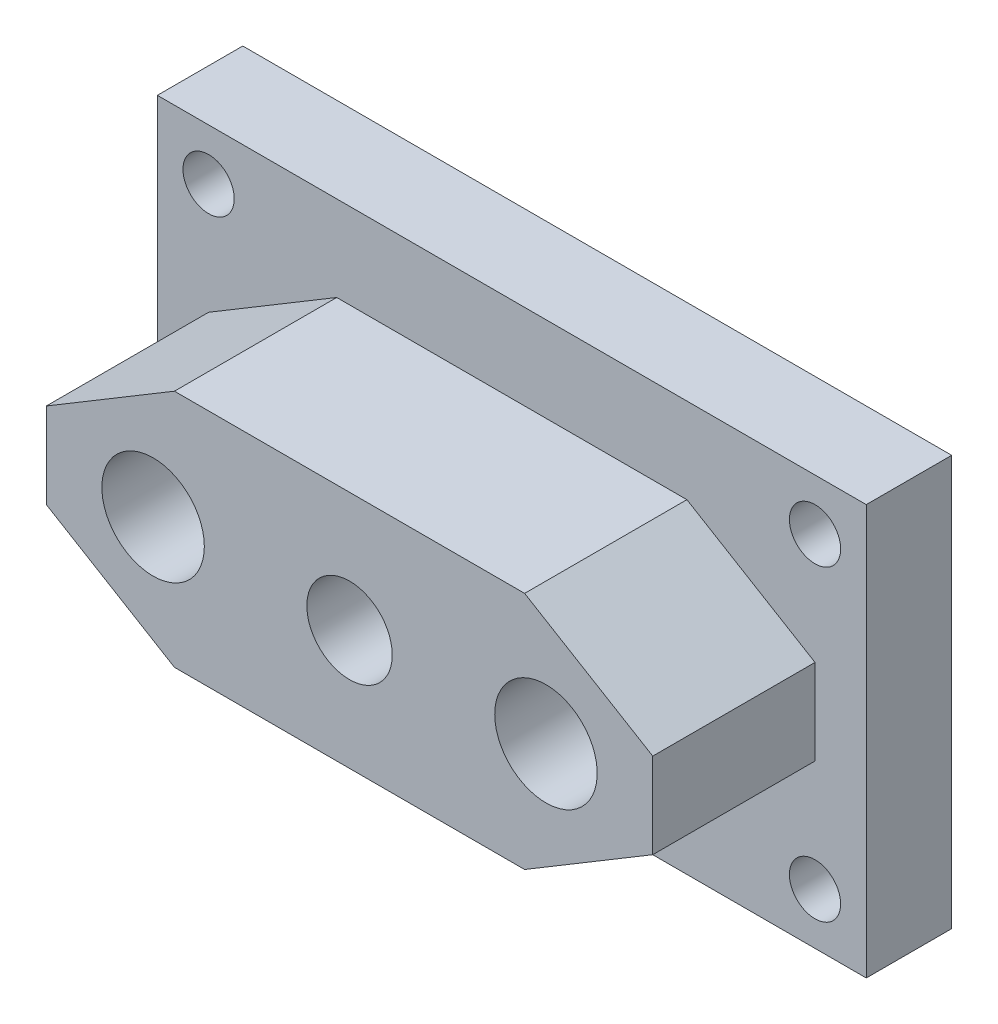
ISO-10303-21;
HEADER;
FILE_DESCRIPTION(('STEP AP214'),'2;1');
FILE_NAME('part.step','',(''),(''),'','','');
FILE_SCHEMA(('AUTOMOTIVE_DESIGN { 1 0 10303 214 1 1 1 1 }'));
ENDSEC;
DATA;
#1=APPLICATION_CONTEXT('core data for automotive mechanical design processes');
#2=APPLICATION_PROTOCOL_DEFINITION('international standard','automotive_design',2000,#1);
#3=PRODUCT_CONTEXT('',#1,'mechanical');
#4=PRODUCT('Part','Part','',(#3));
#5=PRODUCT_RELATED_PRODUCT_CATEGORY('part','',(#4));
#6=PRODUCT_DEFINITION_FORMATION('','',#4);
#7=PRODUCT_DEFINITION_CONTEXT('part definition',#1,'design');
#8=PRODUCT_DEFINITION('design','',#6,#7);
#9=PRODUCT_DEFINITION_SHAPE('','',#8);
#10=(LENGTH_UNIT() NAMED_UNIT(*) SI_UNIT(.MILLI.,.METRE.));
#11=(NAMED_UNIT(*) PLANE_ANGLE_UNIT() SI_UNIT($,.RADIAN.));
#12=(NAMED_UNIT(*) SI_UNIT($,.STERADIAN.) SOLID_ANGLE_UNIT());
#13=UNCERTAINTY_MEASURE_WITH_UNIT(LENGTH_MEASURE(1.E-05),#10,'distance_accuracy_value','');
#14=(GEOMETRIC_REPRESENTATION_CONTEXT(3) GLOBAL_UNCERTAINTY_ASSIGNED_CONTEXT((#13)) GLOBAL_UNIT_ASSIGNED_CONTEXT((#10,
#11,#12)) REPRESENTATION_CONTEXT('',''));
#15=CARTESIAN_POINT('',(0.,0.,0.));
#16=DIRECTION('',(0.,0.,1.));
#17=DIRECTION('',(1.,0.,0.));
#18=AXIS2_PLACEMENT_3D('',#15,#16,#17);
#19=CARTESIAN_POINT('',(0.,0.,10.));
#20=DIRECTION('',(0.,0.,-1.));
#21=DIRECTION('',(-1.,0.,0.));
#22=AXIS2_PLACEMENT_3D('',#19,#20,#21);
#23=PLANE('',#22);
#24=CARTESIAN_POINT('',(-35.5,-18.,10.));
#25=DIRECTION('',(0.,0.,-1.));
#26=DIRECTION('',(-1.,0.,0.));
#27=AXIS2_PLACEMENT_3D('',#24,#25,#26);
#28=CIRCLE('',#27,3.);
#29=CARTESIAN_POINT('',(-38.5,-18.,10.));
#30=VERTEX_POINT('',#29);
#31=EDGE_CURVE('E402',#30,#30,#28,.T.);
#32=ORIENTED_EDGE('',*,*,#31,.T.);
#33=EDGE_LOOP('',(#32));
#34=FACE_BOUND('',#33,.T.);
#35=CARTESIAN_POINT('',(35.5,-18.,10.));
#36=DIRECTION('',(0.,0.,-1.));
#37=DIRECTION('',(-1.,0.,0.));
#38=AXIS2_PLACEMENT_3D('',#35,#36,#37);
#39=CIRCLE('',#38,3.);
#40=CARTESIAN_POINT('',(32.5,-18.,10.));
#41=VERTEX_POINT('',#40);
#42=EDGE_CURVE('E403',#41,#41,#39,.T.);
#43=ORIENTED_EDGE('',*,*,#42,.T.);
#44=EDGE_LOOP('',(#43));
#45=FACE_BOUND('',#44,.T.);
#46=CARTESIAN_POINT('',(35.5,18.,10.));
#47=DIRECTION('',(0.,0.,-1.));
#48=DIRECTION('',(-1.,0.,0.));
#49=AXIS2_PLACEMENT_3D('',#46,#47,#48);
#50=CIRCLE('',#49,3.);
#51=CARTESIAN_POINT('',(32.5,18.,10.));
#52=VERTEX_POINT('',#51);
#53=EDGE_CURVE('E408',#52,#52,#50,.T.);
#54=ORIENTED_EDGE('',*,*,#53,.T.);
#55=EDGE_LOOP('',(#54));
#56=FACE_BOUND('',#55,.T.);
#57=CARTESIAN_POINT('',(-35.5,18.,10.));
#58=DIRECTION('',(0.,0.,-1.));
#59=DIRECTION('',(-1.,0.,0.));
#60=AXIS2_PLACEMENT_3D('',#57,#58,#59);
#61=CIRCLE('',#60,3.);
#62=CARTESIAN_POINT('',(-38.5,18.,10.));
#63=VERTEX_POINT('',#62);
#64=EDGE_CURVE('E463',#63,#63,#61,.T.);
#65=ORIENTED_EDGE('',*,*,#64,.T.);
#66=EDGE_LOOP('',(#65));
#67=FACE_BOUND('',#66,.T.);
#68=DIRECTION('',(0.,1.,0.));
#69=VECTOR('',#68,1.);
#70=CARTESIAN_POINT('',(41.5,-24.,10.));
#71=LINE('',#70,#69);
#72=CARTESIAN_POINT('',(41.5,-24.,10.));
#73=VERTEX_POINT('',#72);
#74=CARTESIAN_POINT('',(41.5,24.,10.));
#75=VERTEX_POINT('',#74);
#76=EDGE_CURVE('E152',#73,#75,#71,.T.);
#77=ORIENTED_EDGE('',*,*,#76,.T.);
#78=DIRECTION('',(-1.,0.,0.));
#79=VECTOR('',#78,1.);
#80=CARTESIAN_POINT('',(-41.5,24.,10.));
#81=LINE('',#80,#79);
#82=CARTESIAN_POINT('',(-41.5,24.,10.));
#83=VERTEX_POINT('',#82);
#84=EDGE_CURVE('E155',#75,#83,#81,.T.);
#85=ORIENTED_EDGE('',*,*,#84,.T.);
#86=DIRECTION('',(0.,-1.,0.));
#87=VECTOR('',#86,1.);
#88=CARTESIAN_POINT('',(-41.5,-24.,10.));
#89=LINE('',#88,#87);
#90=CARTESIAN_POINT('',(-41.5,-24.,10.));
#91=VERTEX_POINT('',#90);
#92=EDGE_CURVE('E158',#83,#91,#89,.T.);
#93=ORIENTED_EDGE('',*,*,#92,.T.);
#94=DIRECTION('',(1.,0.,0.));
#95=VECTOR('',#94,1.);
#96=CARTESIAN_POINT('',(-41.5,-24.,10.));
#97=LINE('',#96,#95);
#98=EDGE_CURVE('E160',#91,#73,#97,.T.);
#99=ORIENTED_EDGE('',*,*,#98,.T.);
#100=EDGE_LOOP('',(#77,#85,#93,#99));
#101=FACE_BOUND('',#100,.T.);
#102=DIRECTION('',(0.,-1.,0.));
#103=VECTOR('',#102,1.);
#104=CARTESIAN_POINT('',(-35.5,-5.,10.));
#105=LINE('',#104,#103);
#106=CARTESIAN_POINT('',(-35.5,5.,10.));
#107=VERTEX_POINT('',#106);
#108=CARTESIAN_POINT('',(-35.5,-5.,10.));
#109=VERTEX_POINT('',#108);
#110=EDGE_CURVE('E49',#107,#109,#105,.T.);
#111=ORIENTED_EDGE('',*,*,#110,.F.);
#112=DIRECTION('',(-0.857492925712544,-0.514495755427526,0.));
#113=VECTOR('',#112,1.);
#114=CARTESIAN_POINT('',(-35.5,5.,10.));
#115=LINE('',#114,#113);
#116=CARTESIAN_POINT('',(-20.5,14.,10.));
#117=VERTEX_POINT('',#116);
#118=EDGE_CURVE('E53',#117,#107,#115,.T.);
#119=ORIENTED_EDGE('',*,*,#118,.F.);
#120=DIRECTION('',(-1.,0.,0.));
#121=VECTOR('',#120,1.);
#122=CARTESIAN_POINT('',(-20.5,14.,10.));
#123=LINE('',#122,#121);
#124=CARTESIAN_POINT('',(20.5,14.,10.));
#125=VERTEX_POINT('',#124);
#126=EDGE_CURVE('E436',#125,#117,#123,.T.);
#127=ORIENTED_EDGE('',*,*,#126,.F.);
#128=DIRECTION('',(-0.857492925712544,0.514495755427526,0.));
#129=VECTOR('',#128,1.);
#130=CARTESIAN_POINT('',(35.5,5.,10.));
#131=LINE('',#130,#129);
#132=CARTESIAN_POINT('',(35.5,5.,10.));
#133=VERTEX_POINT('',#132);
#134=EDGE_CURVE('E433',#133,#125,#131,.T.);
#135=ORIENTED_EDGE('',*,*,#134,.F.);
#136=DIRECTION('',(0.,1.,0.));
#137=VECTOR('',#136,1.);
#138=CARTESIAN_POINT('',(35.5,-5.,10.));
#139=LINE('',#138,#137);
#140=CARTESIAN_POINT('',(35.5,-5.,10.));
#141=VERTEX_POINT('',#140);
#142=EDGE_CURVE('E430',#141,#133,#139,.T.);
#143=ORIENTED_EDGE('',*,*,#142,.F.);
#144=DIRECTION('',(0.857492925712544,0.514495755427526,0.));
#145=VECTOR('',#144,1.);
#146=CARTESIAN_POINT('',(35.5,-5.,10.));
#147=LINE('',#146,#145);
#148=CARTESIAN_POINT('',(20.5,-14.,10.));
#149=VERTEX_POINT('',#148);
#150=EDGE_CURVE('E427',#149,#141,#147,.T.);
#151=ORIENTED_EDGE('',*,*,#150,.F.);
#152=DIRECTION('',(1.,0.,0.));
#153=VECTOR('',#152,1.);
#154=CARTESIAN_POINT('',(-20.5,-14.,10.));
#155=LINE('',#154,#153);
#156=CARTESIAN_POINT('',(-20.5,-14.,10.));
#157=VERTEX_POINT('',#156);
#158=EDGE_CURVE('E424',#157,#149,#155,.T.);
#159=ORIENTED_EDGE('',*,*,#158,.F.);
#160=DIRECTION('',(0.857492925712544,-0.514495755427526,0.));
#161=VECTOR('',#160,1.);
#162=CARTESIAN_POINT('',(-35.5,-5.,10.));
#163=LINE('',#162,#161);
#164=EDGE_CURVE('E405',#109,#157,#163,.T.);
#165=ORIENTED_EDGE('',*,*,#164,.F.);
#166=EDGE_LOOP('',(#111,#119,#127,#135,#143,#151,#159,#165));
#167=FACE_BOUND('',#166,.T.);
#168=ADVANCED_FACE('F34',(#34,#45,#56,#67,#101,#167),#23,.F.);
#169=CARTESIAN_POINT('',(41.5,-24.,10.));
#170=DIRECTION('',(-1.,0.,0.));
#171=DIRECTION('',(0.,0.,1.));
#172=AXIS2_PLACEMENT_3D('',#169,#170,#171);
#173=PLANE('',#172);
#174=DIRECTION('',(0.,1.,0.));
#175=VECTOR('',#174,1.);
#176=CARTESIAN_POINT('',(41.5,-24.,0.));
#177=LINE('',#176,#175);
#178=CARTESIAN_POINT('',(41.5,-24.,0.));
#179=VERTEX_POINT('',#178);
#180=CARTESIAN_POINT('',(41.5,24.,0.));
#181=VERTEX_POINT('',#180);
#182=EDGE_CURVE('E143',#179,#181,#177,.T.);
#183=ORIENTED_EDGE('',*,*,#182,.T.);
#184=DIRECTION('',(0.,0.,-1.));
#185=VECTOR('',#184,1.);
#186=CARTESIAN_POINT('',(41.5,24.,10.));
#187=LINE('',#186,#185);
#188=EDGE_CURVE('E11',#75,#181,#187,.T.);
#189=ORIENTED_EDGE('',*,*,#188,.F.);
#190=ORIENTED_EDGE('',*,*,#76,.F.);
#191=DIRECTION('',(0.,0.,-1.));
#192=VECTOR('',#191,1.);
#193=CARTESIAN_POINT('',(41.5,-24.,10.));
#194=LINE('',#193,#192);
#195=EDGE_CURVE('E161',#73,#179,#194,.T.);
#196=ORIENTED_EDGE('',*,*,#195,.T.);
#197=EDGE_LOOP('',(#183,#189,#190,#196));
#198=FACE_BOUND('',#197,.T.);
#199=ADVANCED_FACE('F36',(#198),#173,.F.);
#200=CARTESIAN_POINT('',(-41.5,24.,10.));
#201=DIRECTION('',(0.,-1.,0.));
#202=DIRECTION('',(0.,0.,-1.));
#203=AXIS2_PLACEMENT_3D('',#200,#201,#202);
#204=PLANE('',#203);
#205=DIRECTION('',(-1.,0.,0.));
#206=VECTOR('',#205,1.);
#207=CARTESIAN_POINT('',(-41.5,24.,0.));
#208=LINE('',#207,#206);
#209=CARTESIAN_POINT('',(-41.5,24.,0.));
#210=VERTEX_POINT('',#209);
#211=EDGE_CURVE('E146',#181,#210,#208,.T.);
#212=ORIENTED_EDGE('',*,*,#211,.T.);
#213=DIRECTION('',(0.,0.,-1.));
#214=VECTOR('',#213,1.);
#215=CARTESIAN_POINT('',(-41.5,24.,10.));
#216=LINE('',#215,#214);
#217=EDGE_CURVE('E42',#83,#210,#216,.T.);
#218=ORIENTED_EDGE('',*,*,#217,.F.);
#219=ORIENTED_EDGE('',*,*,#84,.F.);
#220=ORIENTED_EDGE('',*,*,#188,.T.);
#221=EDGE_LOOP('',(#212,#218,#219,#220));
#222=FACE_BOUND('',#221,.T.);
#223=ADVANCED_FACE('F191',(#222),#204,.F.);
#224=CARTESIAN_POINT('',(-41.5,-24.,10.));
#225=DIRECTION('',(1.,0.,0.));
#226=DIRECTION('',(0.,0.,-1.));
#227=AXIS2_PLACEMENT_3D('',#224,#225,#226);
#228=PLANE('',#227);
#229=DIRECTION('',(0.,-1.,0.));
#230=VECTOR('',#229,1.);
#231=CARTESIAN_POINT('',(-41.5,-24.,0.));
#232=LINE('',#231,#230);
#233=CARTESIAN_POINT('',(-41.5,-24.,0.));
#234=VERTEX_POINT('',#233);
#235=EDGE_CURVE('E164',#210,#234,#232,.T.);
#236=ORIENTED_EDGE('',*,*,#235,.T.);
#237=DIRECTION('',(0.,0.,-1.));
#238=VECTOR('',#237,1.);
#239=CARTESIAN_POINT('',(-41.5,-24.,10.));
#240=LINE('',#239,#238);
#241=EDGE_CURVE('E169',#91,#234,#240,.T.);
#242=ORIENTED_EDGE('',*,*,#241,.F.);
#243=ORIENTED_EDGE('',*,*,#92,.F.);
#244=ORIENTED_EDGE('',*,*,#217,.T.);
#245=EDGE_LOOP('',(#236,#242,#243,#244));
#246=FACE_BOUND('',#245,.T.);
#247=ADVANCED_FACE('F176',(#246),#228,.F.);
#248=CARTESIAN_POINT('',(-41.5,-24.,10.));
#249=DIRECTION('',(0.,1.,0.));
#250=DIRECTION('',(0.,0.,1.));
#251=AXIS2_PLACEMENT_3D('',#248,#249,#250);
#252=PLANE('',#251);
#253=DIRECTION('',(1.,0.,0.));
#254=VECTOR('',#253,1.);
#255=CARTESIAN_POINT('',(-41.5,-24.,0.));
#256=LINE('',#255,#254);
#257=EDGE_CURVE('E156',#234,#179,#256,.T.);
#258=ORIENTED_EDGE('',*,*,#257,.T.);
#259=ORIENTED_EDGE('',*,*,#195,.F.);
#260=ORIENTED_EDGE('',*,*,#98,.F.);
#261=ORIENTED_EDGE('',*,*,#241,.T.);
#262=EDGE_LOOP('',(#258,#259,#260,#261));
#263=FACE_BOUND('',#262,.T.);
#264=ADVANCED_FACE('F185',(#263),#252,.F.);
#265=CARTESIAN_POINT('',(0.,0.,0.));
#266=DIRECTION('',(0.,0.,-1.));
#267=DIRECTION('',(-1.,0.,0.));
#268=AXIS2_PLACEMENT_3D('',#265,#266,#267);
#269=PLANE('',#268);
#270=CARTESIAN_POINT('',(-35.5,-18.,0.));
#271=DIRECTION('',(0.,0.,1.));
#272=DIRECTION('',(-1.,0.,0.));
#273=AXIS2_PLACEMENT_3D('',#270,#271,#272);
#274=CIRCLE('',#273,3.);
#275=CARTESIAN_POINT('',(-38.5,-18.,0.));
#276=VERTEX_POINT('',#275);
#277=EDGE_CURVE('E400',#276,#276,#274,.T.);
#278=ORIENTED_EDGE('',*,*,#277,.T.);
#279=EDGE_LOOP('',(#278));
#280=FACE_BOUND('',#279,.T.);
#281=CARTESIAN_POINT('',(35.5,-18.,0.));
#282=DIRECTION('',(0.,0.,1.));
#283=DIRECTION('',(1.,0.,0.));
#284=AXIS2_PLACEMENT_3D('',#281,#282,#283);
#285=CIRCLE('',#284,3.);
#286=CARTESIAN_POINT('',(38.5,-18.,0.));
#287=VERTEX_POINT('',#286);
#288=EDGE_CURVE('E474',#287,#287,#285,.T.);
#289=ORIENTED_EDGE('',*,*,#288,.T.);
#290=EDGE_LOOP('',(#289));
#291=FACE_BOUND('',#290,.T.);
#292=CARTESIAN_POINT('',(35.5,18.,0.));
#293=DIRECTION('',(0.,0.,1.));
#294=DIRECTION('',(-1.,0.,0.));
#295=AXIS2_PLACEMENT_3D('',#292,#293,#294);
#296=CIRCLE('',#295,3.);
#297=CARTESIAN_POINT('',(32.5,18.,0.));
#298=VERTEX_POINT('',#297);
#299=EDGE_CURVE('E477',#298,#298,#296,.T.);
#300=ORIENTED_EDGE('',*,*,#299,.T.);
#301=EDGE_LOOP('',(#300));
#302=FACE_BOUND('',#301,.T.);
#303=CARTESIAN_POINT('',(-35.5,18.,0.));
#304=DIRECTION('',(0.,0.,1.));
#305=DIRECTION('',(1.,0.,0.));
#306=AXIS2_PLACEMENT_3D('',#303,#304,#305);
#307=CIRCLE('',#306,3.);
#308=CARTESIAN_POINT('',(-32.5,18.,0.));
#309=VERTEX_POINT('',#308);
#310=EDGE_CURVE('E480',#309,#309,#307,.T.);
#311=ORIENTED_EDGE('',*,*,#310,.T.);
#312=EDGE_LOOP('',(#311));
#313=FACE_BOUND('',#312,.T.);
#314=CARTESIAN_POINT('',(23.,0.,0.));
#315=DIRECTION('',(0.,0.,1.));
#316=DIRECTION('',(-1.,0.,0.));
#317=AXIS2_PLACEMENT_3D('',#314,#315,#316);
#318=CIRCLE('',#317,6.);
#319=CARTESIAN_POINT('',(17.,0.,0.));
#320=VERTEX_POINT('',#319);
#321=EDGE_CURVE('E486',#320,#320,#318,.T.);
#322=ORIENTED_EDGE('',*,*,#321,.T.);
#323=EDGE_LOOP('',(#322));
#324=FACE_BOUND('',#323,.T.);
#325=CARTESIAN_POINT('',(-23.,0.,0.));
#326=DIRECTION('',(0.,0.,1.));
#327=DIRECTION('',(1.,0.,0.));
#328=AXIS2_PLACEMENT_3D('',#325,#326,#327);
#329=CIRCLE('',#328,6.);
#330=CARTESIAN_POINT('',(-17.,0.,0.));
#331=VERTEX_POINT('',#330);
#332=EDGE_CURVE('E470',#331,#331,#329,.T.);
#333=ORIENTED_EDGE('',*,*,#332,.T.);
#334=EDGE_LOOP('',(#333));
#335=FACE_BOUND('',#334,.T.);
#336=CARTESIAN_POINT('',(0.,0.,0.));
#337=DIRECTION('',(0.,0.,1.));
#338=DIRECTION('',(1.,0.,0.));
#339=AXIS2_PLACEMENT_3D('',#336,#337,#338);
#340=CIRCLE('',#339,5.);
#341=CARTESIAN_POINT('',(5.,0.,0.));
#342=VERTEX_POINT('',#341);
#343=EDGE_CURVE('E466',#342,#342,#340,.T.);
#344=ORIENTED_EDGE('',*,*,#343,.T.);
#345=EDGE_LOOP('',(#344));
#346=FACE_BOUND('',#345,.T.);
#347=ORIENTED_EDGE('',*,*,#182,.F.);
#348=ORIENTED_EDGE('',*,*,#257,.F.);
#349=ORIENTED_EDGE('',*,*,#235,.F.);
#350=ORIENTED_EDGE('',*,*,#211,.F.);
#351=EDGE_LOOP('',(#347,#348,#349,#350));
#352=FACE_BOUND('',#351,.T.);
#353=ADVANCED_FACE('F182',(#280,#291,#302,#313,#324,#335,#346,#352),#269,.T.);
#354=CARTESIAN_POINT('',(-35.5,-5.,29.));
#355=DIRECTION('',(1.,0.,0.));
#356=DIRECTION('',(0.,0.,-1.));
#357=AXIS2_PLACEMENT_3D('',#354,#355,#356);
#358=PLANE('',#357);
#359=ORIENTED_EDGE('',*,*,#110,.T.);
#360=DIRECTION('',(0.,0.,-1.));
#361=VECTOR('',#360,1.);
#362=CARTESIAN_POINT('',(-35.5,-5.,29.));
#363=LINE('',#362,#361);
#364=CARTESIAN_POINT('',(-35.5,-5.,29.));
#365=VERTEX_POINT('',#364);
#366=EDGE_CURVE('E126',#365,#109,#363,.T.);
#367=ORIENTED_EDGE('',*,*,#366,.F.);
#368=DIRECTION('',(0.,-1.,0.));
#369=VECTOR('',#368,1.);
#370=CARTESIAN_POINT('',(-35.5,-5.,29.));
#371=LINE('',#370,#369);
#372=CARTESIAN_POINT('',(-35.5,5.,29.));
#373=VERTEX_POINT('',#372);
#374=EDGE_CURVE('E132',#373,#365,#371,.T.);
#375=ORIENTED_EDGE('',*,*,#374,.F.);
#376=DIRECTION('',(0.,0.,-1.));
#377=VECTOR('',#376,1.);
#378=CARTESIAN_POINT('',(-35.5,5.,29.));
#379=LINE('',#378,#377);
#380=EDGE_CURVE('E421',#373,#107,#379,.T.);
#381=ORIENTED_EDGE('',*,*,#380,.T.);
#382=EDGE_LOOP('',(#359,#367,#375,#381));
#383=FACE_BOUND('',#382,.T.);
#384=ADVANCED_FACE('F142',(#383),#358,.F.);
#385=CARTESIAN_POINT('',(-35.5,-5.,29.));
#386=DIRECTION('',(0.514495755427526,0.857492925712544,0.));
#387=DIRECTION('',(-0.857492925712544,0.514495755427526,0.));
#388=AXIS2_PLACEMENT_3D('',#385,#386,#387);
#389=PLANE('',#388);
#390=ORIENTED_EDGE('',*,*,#164,.T.);
#391=DIRECTION('',(0.,0.,-1.));
#392=VECTOR('',#391,1.);
#393=CARTESIAN_POINT('',(-20.5,-14.,29.));
#394=LINE('',#393,#392);
#395=CARTESIAN_POINT('',(-20.5,-14.,29.));
#396=VERTEX_POINT('',#395);
#397=EDGE_CURVE('E128',#396,#157,#394,.T.);
#398=ORIENTED_EDGE('',*,*,#397,.F.);
#399=DIRECTION('',(0.857492925712544,-0.514495755427526,0.));
#400=VECTOR('',#399,1.);
#401=CARTESIAN_POINT('',(-35.5,-5.,29.));
#402=LINE('',#401,#400);
#403=EDGE_CURVE('E121',#365,#396,#402,.T.);
#404=ORIENTED_EDGE('',*,*,#403,.F.);
#405=ORIENTED_EDGE('',*,*,#366,.T.);
#406=EDGE_LOOP('',(#390,#398,#404,#405));
#407=FACE_BOUND('',#406,.T.);
#408=ADVANCED_FACE('F124',(#407),#389,.F.);
#409=CARTESIAN_POINT('',(-20.5,-14.,29.));
#410=DIRECTION('',(0.,1.,0.));
#411=DIRECTION('',(0.,0.,1.));
#412=AXIS2_PLACEMENT_3D('',#409,#410,#411);
#413=PLANE('',#412);
#414=ORIENTED_EDGE('',*,*,#158,.T.);
#415=DIRECTION('',(0.,0.,-1.));
#416=VECTOR('',#415,1.);
#417=CARTESIAN_POINT('',(20.5,-14.,29.));
#418=LINE('',#417,#416);
#419=CARTESIAN_POINT('',(20.5,-14.,29.));
#420=VERTEX_POINT('',#419);
#421=EDGE_CURVE('E148',#420,#149,#418,.T.);
#422=ORIENTED_EDGE('',*,*,#421,.F.);
#423=DIRECTION('',(1.,0.,0.));
#424=VECTOR('',#423,1.);
#425=CARTESIAN_POINT('',(-20.5,-14.,29.));
#426=LINE('',#425,#424);
#427=EDGE_CURVE('E131',#396,#420,#426,.T.);
#428=ORIENTED_EDGE('',*,*,#427,.F.);
#429=ORIENTED_EDGE('',*,*,#397,.T.);
#430=EDGE_LOOP('',(#414,#422,#428,#429));
#431=FACE_BOUND('',#430,.T.);
#432=ADVANCED_FACE('F232',(#431),#413,.F.);
#433=CARTESIAN_POINT('',(35.5,-5.,29.));
#434=DIRECTION('',(-0.514495755427526,0.857492925712544,0.));
#435=DIRECTION('',(-0.857492925712544,-0.514495755427526,0.));
#436=AXIS2_PLACEMENT_3D('',#433,#434,#435);
#437=PLANE('',#436);
#438=ORIENTED_EDGE('',*,*,#150,.T.);
#439=DIRECTION('',(0.,0.,-1.));
#440=VECTOR('',#439,1.);
#441=CARTESIAN_POINT('',(35.5,-5.,29.));
#442=LINE('',#441,#440);
#443=CARTESIAN_POINT('',(35.5,-5.,29.));
#444=VERTEX_POINT('',#443);
#445=EDGE_CURVE('E449',#444,#141,#442,.T.);
#446=ORIENTED_EDGE('',*,*,#445,.F.);
#447=DIRECTION('',(0.857492925712544,0.514495755427526,0.));
#448=VECTOR('',#447,1.);
#449=CARTESIAN_POINT('',(35.5,-5.,29.));
#450=LINE('',#449,#448);
#451=EDGE_CURVE('E413',#420,#444,#450,.T.);
#452=ORIENTED_EDGE('',*,*,#451,.F.);
#453=ORIENTED_EDGE('',*,*,#421,.T.);
#454=EDGE_LOOP('',(#438,#446,#452,#453));
#455=FACE_BOUND('',#454,.T.);
#456=ADVANCED_FACE('F238',(#455),#437,.F.);
#457=CARTESIAN_POINT('',(35.5,-5.,29.));
#458=DIRECTION('',(-1.,0.,0.));
#459=DIRECTION('',(0.,0.,1.));
#460=AXIS2_PLACEMENT_3D('',#457,#458,#459);
#461=PLANE('',#460);
#462=ORIENTED_EDGE('',*,*,#142,.T.);
#463=DIRECTION('',(0.,0.,-1.));
#464=VECTOR('',#463,1.);
#465=CARTESIAN_POINT('',(35.5,5.,29.));
#466=LINE('',#465,#464);
#467=CARTESIAN_POINT('',(35.5,5.,29.));
#468=VERTEX_POINT('',#467);
#469=EDGE_CURVE('E446',#468,#133,#466,.T.);
#470=ORIENTED_EDGE('',*,*,#469,.F.);
#471=DIRECTION('',(0.,1.,0.));
#472=VECTOR('',#471,1.);
#473=CARTESIAN_POINT('',(35.5,-5.,29.));
#474=LINE('',#473,#472);
#475=EDGE_CURVE('E415',#444,#468,#474,.T.);
#476=ORIENTED_EDGE('',*,*,#475,.F.);
#477=ORIENTED_EDGE('',*,*,#445,.T.);
#478=EDGE_LOOP('',(#462,#470,#476,#477));
#479=FACE_BOUND('',#478,.T.);
#480=ADVANCED_FACE('F246',(#479),#461,.F.);
#481=CARTESIAN_POINT('',(35.5,5.,29.));
#482=DIRECTION('',(-0.514495755427526,-0.857492925712544,0.));
#483=DIRECTION('',(0.857492925712544,-0.514495755427526,0.));
#484=AXIS2_PLACEMENT_3D('',#481,#482,#483);
#485=PLANE('',#484);
#486=ORIENTED_EDGE('',*,*,#134,.T.);
#487=DIRECTION('',(0.,0.,-1.));
#488=VECTOR('',#487,1.);
#489=CARTESIAN_POINT('',(20.5,14.,29.));
#490=LINE('',#489,#488);
#491=CARTESIAN_POINT('',(20.5,14.,29.));
#492=VERTEX_POINT('',#491);
#493=EDGE_CURVE('E443',#492,#125,#490,.T.);
#494=ORIENTED_EDGE('',*,*,#493,.F.);
#495=DIRECTION('',(-0.857492925712544,0.514495755427526,0.));
#496=VECTOR('',#495,1.);
#497=CARTESIAN_POINT('',(35.5,5.,29.));
#498=LINE('',#497,#496);
#499=EDGE_CURVE('E417',#468,#492,#498,.T.);
#500=ORIENTED_EDGE('',*,*,#499,.F.);
#501=ORIENTED_EDGE('',*,*,#469,.T.);
#502=EDGE_LOOP('',(#486,#494,#500,#501));
#503=FACE_BOUND('',#502,.T.);
#504=ADVANCED_FACE('F254',(#503),#485,.F.);
#505=CARTESIAN_POINT('',(-20.5,14.,29.));
#506=DIRECTION('',(0.,-1.,0.));
#507=DIRECTION('',(0.,0.,-1.));
#508=AXIS2_PLACEMENT_3D('',#505,#506,#507);
#509=PLANE('',#508);
#510=ORIENTED_EDGE('',*,*,#126,.T.);
#511=DIRECTION('',(0.,0.,-1.));
#512=VECTOR('',#511,1.);
#513=CARTESIAN_POINT('',(-20.5,14.,29.));
#514=LINE('',#513,#512);
#515=CARTESIAN_POINT('',(-20.5,14.,29.));
#516=VERTEX_POINT('',#515);
#517=EDGE_CURVE('E440',#516,#117,#514,.T.);
#518=ORIENTED_EDGE('',*,*,#517,.F.);
#519=DIRECTION('',(-1.,0.,0.));
#520=VECTOR('',#519,1.);
#521=CARTESIAN_POINT('',(-20.5,14.,29.));
#522=LINE('',#521,#520);
#523=EDGE_CURVE('E419',#492,#516,#522,.T.);
#524=ORIENTED_EDGE('',*,*,#523,.F.);
#525=ORIENTED_EDGE('',*,*,#493,.T.);
#526=EDGE_LOOP('',(#510,#518,#524,#525));
#527=FACE_BOUND('',#526,.T.);
#528=ADVANCED_FACE('F262',(#527),#509,.F.);
#529=CARTESIAN_POINT('',(-35.5,5.,29.));
#530=DIRECTION('',(0.514495755427526,-0.857492925712544,0.));
#531=DIRECTION('',(0.857492925712544,0.514495755427526,0.));
#532=AXIS2_PLACEMENT_3D('',#529,#530,#531);
#533=PLANE('',#532);
#534=ORIENTED_EDGE('',*,*,#118,.T.);
#535=ORIENTED_EDGE('',*,*,#380,.F.);
#536=DIRECTION('',(-0.857492925712544,-0.514495755427526,0.));
#537=VECTOR('',#536,1.);
#538=CARTESIAN_POINT('',(-35.5,5.,29.));
#539=LINE('',#538,#537);
#540=EDGE_CURVE('E137',#516,#373,#539,.T.);
#541=ORIENTED_EDGE('',*,*,#540,.F.);
#542=ORIENTED_EDGE('',*,*,#517,.T.);
#543=EDGE_LOOP('',(#534,#535,#541,#542));
#544=FACE_BOUND('',#543,.T.);
#545=ADVANCED_FACE('F270',(#544),#533,.F.);
#546=CARTESIAN_POINT('',(0.,0.,29.));
#547=DIRECTION('',(0.,0.,-1.));
#548=DIRECTION('',(-1.,0.,0.));
#549=AXIS2_PLACEMENT_3D('',#546,#547,#548);
#550=PLANE('',#549);
#551=CARTESIAN_POINT('',(23.,0.,29.));
#552=DIRECTION('',(0.,0.,1.));
#553=DIRECTION('',(-1.,0.,0.));
#554=AXIS2_PLACEMENT_3D('',#551,#552,#553);
#555=CIRCLE('',#554,6.);
#556=CARTESIAN_POINT('',(17.,0.,29.));
#557=VERTEX_POINT('',#556);
#558=EDGE_CURVE('E483',#557,#557,#555,.T.);
#559=ORIENTED_EDGE('',*,*,#558,.F.);
#560=EDGE_LOOP('',(#559));
#561=FACE_BOUND('',#560,.T.);
#562=CARTESIAN_POINT('',(-23.,0.,29.));
#563=DIRECTION('',(0.,0.,1.));
#564=DIRECTION('',(1.,0.,0.));
#565=AXIS2_PLACEMENT_3D('',#562,#563,#564);
#566=CIRCLE('',#565,6.);
#567=CARTESIAN_POINT('',(-17.,0.,29.));
#568=VERTEX_POINT('',#567);
#569=EDGE_CURVE('E489',#568,#568,#566,.T.);
#570=ORIENTED_EDGE('',*,*,#569,.F.);
#571=EDGE_LOOP('',(#570));
#572=FACE_BOUND('',#571,.T.);
#573=CARTESIAN_POINT('',(0.,0.,29.));
#574=DIRECTION('',(0.,0.,1.));
#575=DIRECTION('',(1.,0.,0.));
#576=AXIS2_PLACEMENT_3D('',#573,#574,#575);
#577=CIRCLE('',#576,5.);
#578=CARTESIAN_POINT('',(5.,0.,29.));
#579=VERTEX_POINT('',#578);
#580=EDGE_CURVE('E467',#579,#579,#577,.T.);
#581=ORIENTED_EDGE('',*,*,#580,.F.);
#582=EDGE_LOOP('',(#581));
#583=FACE_BOUND('',#582,.T.);
#584=ORIENTED_EDGE('',*,*,#374,.T.);
#585=ORIENTED_EDGE('',*,*,#403,.T.);
#586=ORIENTED_EDGE('',*,*,#427,.T.);
#587=ORIENTED_EDGE('',*,*,#451,.T.);
#588=ORIENTED_EDGE('',*,*,#475,.T.);
#589=ORIENTED_EDGE('',*,*,#499,.T.);
#590=ORIENTED_EDGE('',*,*,#523,.T.);
#591=ORIENTED_EDGE('',*,*,#540,.T.);
#592=EDGE_LOOP('',(#584,#585,#586,#587,#588,#589,#590,#591));
#593=FACE_BOUND('',#592,.T.);
#594=ADVANCED_FACE('F135',(#561,#572,#583,#593),#550,.F.);
#595=CARTESIAN_POINT('',(0.,0.,0.));
#596=DIRECTION('',(0.,0.,1.));
#597=DIRECTION('',(1.,0.,0.));
#598=AXIS2_PLACEMENT_3D('',#595,#596,#597);
#599=CYLINDRICAL_SURFACE('',#598,5.);
#600=ORIENTED_EDGE('',*,*,#343,.F.);
#601=EDGE_LOOP('',(#600));
#602=FACE_BOUND('',#601,.T.);
#603=ORIENTED_EDGE('',*,*,#580,.T.);
#604=EDGE_LOOP('',(#603));
#605=FACE_BOUND('',#604,.T.);
#606=ADVANCED_FACE('F284',(#602,#605),#599,.F.);
#607=CARTESIAN_POINT('',(-23.,0.,0.));
#608=DIRECTION('',(0.,0.,1.));
#609=DIRECTION('',(1.,0.,0.));
#610=AXIS2_PLACEMENT_3D('',#607,#608,#609);
#611=CYLINDRICAL_SURFACE('',#610,6.);
#612=ORIENTED_EDGE('',*,*,#332,.F.);
#613=EDGE_LOOP('',(#612));
#614=FACE_BOUND('',#613,.T.);
#615=ORIENTED_EDGE('',*,*,#569,.T.);
#616=EDGE_LOOP('',(#615));
#617=FACE_BOUND('',#616,.T.);
#618=ADVANCED_FACE('F292',(#614,#617),#611,.F.);
#619=CARTESIAN_POINT('',(23.,0.,0.));
#620=DIRECTION('',(0.,0.,1.));
#621=DIRECTION('',(1.,0.,0.));
#622=AXIS2_PLACEMENT_3D('',#619,#620,#621);
#623=CYLINDRICAL_SURFACE('',#622,6.);
#624=ORIENTED_EDGE('',*,*,#321,.F.);
#625=EDGE_LOOP('',(#624));
#626=FACE_BOUND('',#625,.T.);
#627=ORIENTED_EDGE('',*,*,#558,.T.);
#628=EDGE_LOOP('',(#627));
#629=FACE_BOUND('',#628,.T.);
#630=ADVANCED_FACE('F300',(#626,#629),#623,.F.);
#631=CARTESIAN_POINT('',(-35.5,18.,0.));
#632=DIRECTION('',(0.,0.,1.));
#633=DIRECTION('',(1.,0.,0.));
#634=AXIS2_PLACEMENT_3D('',#631,#632,#633);
#635=CYLINDRICAL_SURFACE('',#634,3.);
#636=ORIENTED_EDGE('',*,*,#310,.F.);
#637=EDGE_LOOP('',(#636));
#638=FACE_BOUND('',#637,.T.);
#639=ORIENTED_EDGE('',*,*,#64,.F.);
#640=EDGE_LOOP('',(#639));
#641=FACE_BOUND('',#640,.T.);
#642=ADVANCED_FACE('F308',(#638,#641),#635,.F.);
#643=CARTESIAN_POINT('',(35.5,18.,0.));
#644=DIRECTION('',(0.,0.,1.));
#645=DIRECTION('',(1.,0.,0.));
#646=AXIS2_PLACEMENT_3D('',#643,#644,#645);
#647=CYLINDRICAL_SURFACE('',#646,3.);
#648=ORIENTED_EDGE('',*,*,#299,.F.);
#649=EDGE_LOOP('',(#648));
#650=FACE_BOUND('',#649,.T.);
#651=ORIENTED_EDGE('',*,*,#53,.F.);
#652=EDGE_LOOP('',(#651));
#653=FACE_BOUND('',#652,.T.);
#654=ADVANCED_FACE('F316',(#650,#653),#647,.F.);
#655=CARTESIAN_POINT('',(35.5,-18.,0.));
#656=DIRECTION('',(0.,0.,1.));
#657=DIRECTION('',(1.,0.,0.));
#658=AXIS2_PLACEMENT_3D('',#655,#656,#657);
#659=CYLINDRICAL_SURFACE('',#658,3.);
#660=ORIENTED_EDGE('',*,*,#288,.F.);
#661=EDGE_LOOP('',(#660));
#662=FACE_BOUND('',#661,.T.);
#663=ORIENTED_EDGE('',*,*,#42,.F.);
#664=EDGE_LOOP('',(#663));
#665=FACE_BOUND('',#664,.T.);
#666=ADVANCED_FACE('F324',(#662,#665),#659,.F.);
#667=CARTESIAN_POINT('',(-35.5,-18.,0.));
#668=DIRECTION('',(0.,0.,1.));
#669=DIRECTION('',(1.,0.,0.));
#670=AXIS2_PLACEMENT_3D('',#667,#668,#669);
#671=CYLINDRICAL_SURFACE('',#670,3.);
#672=ORIENTED_EDGE('',*,*,#277,.F.);
#673=EDGE_LOOP('',(#672));
#674=FACE_BOUND('',#673,.T.);
#675=ORIENTED_EDGE('',*,*,#31,.F.);
#676=EDGE_LOOP('',(#675));
#677=FACE_BOUND('',#676,.T.);
#678=ADVANCED_FACE('F332',(#674,#677),#671,.F.);
#679=CLOSED_SHELL('',(#168,#199,#223,#247,#264,#353,#384,#408,#432,#456,#480,#504,#528,#545,
#594,#606,#618,#630,#642,#654,#666,#678));
#680=MANIFOLD_SOLID_BREP('B2',#679);
#681=ADVANCED_BREP_SHAPE_REPRESENTATION('',(#18,#680),#14);
#682=SHAPE_DEFINITION_REPRESENTATION(#9,#681);
ENDSEC;
END-ISO-10303-21;
